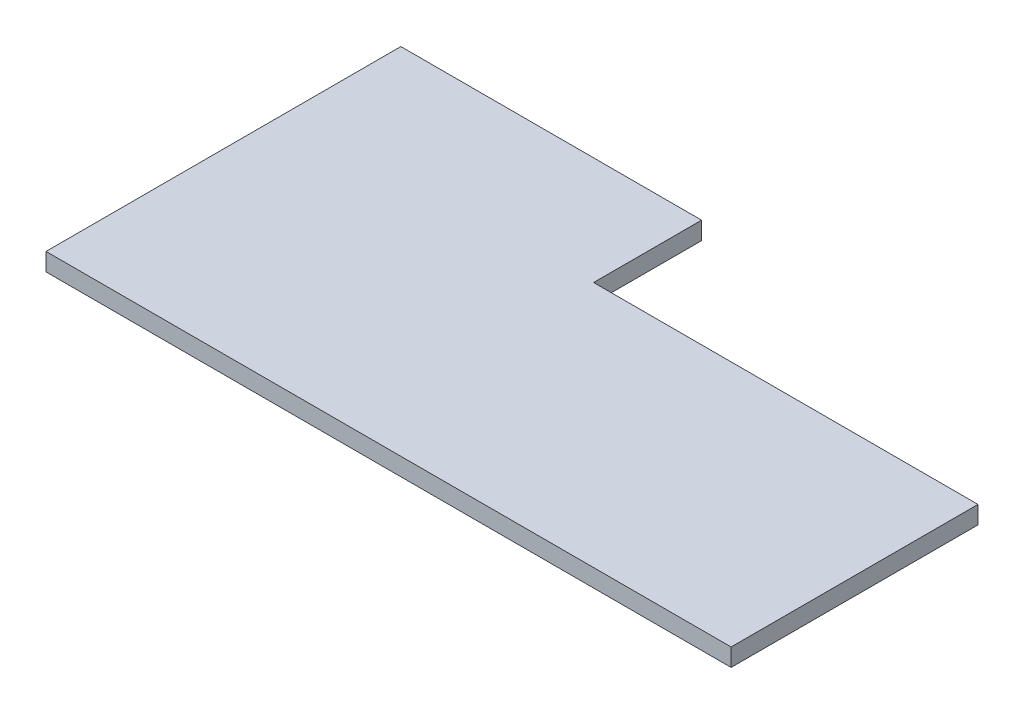
ISO-10303-21;
HEADER;
FILE_DESCRIPTION(('STEP AP214'),'2;1');
FILE_NAME('part.step','',(''),(''),'','','');
FILE_SCHEMA(('AUTOMOTIVE_DESIGN { 1 0 10303 214 1 1 1 1 }'));
ENDSEC;
DATA;
#1=APPLICATION_CONTEXT('core data for automotive mechanical design processes');
#2=APPLICATION_PROTOCOL_DEFINITION('international standard','automotive_design',2000,#1);
#3=PRODUCT_CONTEXT('',#1,'mechanical');
#4=PRODUCT('Part','Part','',(#3));
#5=PRODUCT_RELATED_PRODUCT_CATEGORY('part','',(#4));
#6=PRODUCT_DEFINITION_FORMATION('','',#4);
#7=PRODUCT_DEFINITION_CONTEXT('part definition',#1,'design');
#8=PRODUCT_DEFINITION('design','',#6,#7);
#9=PRODUCT_DEFINITION_SHAPE('','',#8);
#10=(LENGTH_UNIT() NAMED_UNIT(*) SI_UNIT(.MILLI.,.METRE.));
#11=(NAMED_UNIT(*) PLANE_ANGLE_UNIT() SI_UNIT($,.RADIAN.));
#12=(NAMED_UNIT(*) SI_UNIT($,.STERADIAN.) SOLID_ANGLE_UNIT());
#13=UNCERTAINTY_MEASURE_WITH_UNIT(LENGTH_MEASURE(1.E-05),#10,'distance_accuracy_value','');
#14=(GEOMETRIC_REPRESENTATION_CONTEXT(3) GLOBAL_UNCERTAINTY_ASSIGNED_CONTEXT((#13)) GLOBAL_UNIT_ASSIGNED_CONTEXT((#10,
#11,#12)) REPRESENTATION_CONTEXT('',''));
#15=CARTESIAN_POINT('',(0.,0.,0.));
#16=DIRECTION('',(0.,0.,1.));
#17=DIRECTION('',(1.,0.,0.));
#18=AXIS2_PLACEMENT_3D('',#15,#16,#17);
#19=CARTESIAN_POINT('',(35.593368159927,2.95,3.68220593071904));
#20=DIRECTION('',(0.,0.,1.));
#21=DIRECTION('',(1.,0.,0.));
#22=AXIS2_PLACEMENT_3D('',#19,#20,#21);
#23=PLANE('',#22);
#24=DIRECTION('',(-1.,0.,0.));
#25=VECTOR('',#24,1.);
#26=CARTESIAN_POINT('',(35.593368159927,0.,3.68220593071904));
#27=LINE('',#26,#25);
#28=CARTESIAN_POINT('',(99.503368159927,0.,3.68220593071904));
#29=VERTEX_POINT('',#28);
#30=CARTESIAN_POINT('',(35.593368159927,0.,3.68220593071904));
#31=VERTEX_POINT('',#30);
#32=EDGE_CURVE('E116',#29,#31,#27,.T.);
#33=ORIENTED_EDGE('',*,*,#32,.T.);
#34=DIRECTION('',(0.,-1.,0.));
#35=VECTOR('',#34,1.);
#36=CARTESIAN_POINT('',(35.593368159927,2.95,3.68220593071904));
#37=LINE('',#36,#35);
#38=CARTESIAN_POINT('',(35.593368159927,2.95,3.68220593071904));
#39=VERTEX_POINT('',#38);
#40=EDGE_CURVE('E11',#39,#31,#37,.T.);
#41=ORIENTED_EDGE('',*,*,#40,.F.);
#42=DIRECTION('',(-1.,0.,0.));
#43=VECTOR('',#42,1.);
#44=CARTESIAN_POINT('',(35.593368159927,2.95,3.68220593071904));
#45=LINE('',#44,#43);
#46=CARTESIAN_POINT('',(99.503368159927,2.95,3.68220593071904));
#47=VERTEX_POINT('',#46);
#48=EDGE_CURVE('E127',#47,#39,#45,.T.);
#49=ORIENTED_EDGE('',*,*,#48,.F.);
#50=DIRECTION('',(0.,-1.,0.));
#51=VECTOR('',#50,1.);
#52=CARTESIAN_POINT('',(99.503368159927,2.95,3.68220593071904));
#53=LINE('',#52,#51);
#54=EDGE_CURVE('E112',#47,#29,#53,.T.);
#55=ORIENTED_EDGE('',*,*,#54,.T.);
#56=EDGE_LOOP('',(#33,#41,#49,#55));
#57=FACE_BOUND('',#56,.T.);
#58=ADVANCED_FACE('F33',(#57),#23,.F.);
#59=CARTESIAN_POINT('',(35.593368159927,2.95,-14.267794069281));
#60=DIRECTION('',(-1.,0.,0.));
#61=DIRECTION('',(0.,0.,1.));
#62=AXIS2_PLACEMENT_3D('',#59,#60,#61);
#63=PLANE('',#62);
#64=DIRECTION('',(0.,0.,-1.));
#65=VECTOR('',#64,1.);
#66=CARTESIAN_POINT('',(35.593368159927,0.,-14.267794069281));
#67=LINE('',#66,#65);
#68=CARTESIAN_POINT('',(35.593368159927,0.,-14.267794069281));
#69=VERTEX_POINT('',#68);
#70=EDGE_CURVE('E119',#31,#69,#67,.T.);
#71=ORIENTED_EDGE('',*,*,#70,.T.);
#72=DIRECTION('',(0.,-1.,0.));
#73=VECTOR('',#72,1.);
#74=CARTESIAN_POINT('',(35.593368159927,2.95,-14.267794069281));
#75=LINE('',#74,#73);
#76=CARTESIAN_POINT('',(35.593368159927,2.95,-14.267794069281));
#77=VERTEX_POINT('',#76);
#78=EDGE_CURVE('E41',#77,#69,#75,.T.);
#79=ORIENTED_EDGE('',*,*,#78,.F.);
#80=DIRECTION('',(0.,0.,-1.));
#81=VECTOR('',#80,1.);
#82=CARTESIAN_POINT('',(35.593368159927,2.95,-14.267794069281));
#83=LINE('',#82,#81);
#84=EDGE_CURVE('E86',#39,#77,#83,.T.);
#85=ORIENTED_EDGE('',*,*,#84,.F.);
#86=ORIENTED_EDGE('',*,*,#40,.T.);
#87=EDGE_LOOP('',(#71,#79,#85,#86));
#88=FACE_BOUND('',#87,.T.);
#89=ADVANCED_FACE('F151',(#88),#63,.F.);
#90=CARTESIAN_POINT('',(-14.406631840073,2.95,-14.267794069281));
#91=DIRECTION('',(0.,0.,1.));
#92=DIRECTION('',(1.,0.,0.));
#93=AXIS2_PLACEMENT_3D('',#90,#91,#92);
#94=PLANE('',#93);
#95=DIRECTION('',(-1.,0.,0.));
#96=VECTOR('',#95,1.);
#97=CARTESIAN_POINT('',(-14.406631840073,0.,-14.267794069281));
#98=LINE('',#97,#96);
#99=CARTESIAN_POINT('',(-14.406631840073,0.,-14.267794069281));
#100=VERTEX_POINT('',#99);
#101=EDGE_CURVE('E121',#69,#100,#98,.T.);
#102=ORIENTED_EDGE('',*,*,#101,.T.);
#103=DIRECTION('',(0.,-1.,0.));
#104=VECTOR('',#103,1.);
#105=CARTESIAN_POINT('',(-14.406631840073,2.95,-14.267794069281));
#106=LINE('',#105,#104);
#107=CARTESIAN_POINT('',(-14.406631840073,2.95,-14.267794069281));
#108=VERTEX_POINT('',#107);
#109=EDGE_CURVE('E107',#108,#100,#106,.T.);
#110=ORIENTED_EDGE('',*,*,#109,.F.);
#111=DIRECTION('',(-1.,0.,0.));
#112=VECTOR('',#111,1.);
#113=CARTESIAN_POINT('',(-14.406631840073,2.95,-14.267794069281));
#114=LINE('',#113,#112);
#115=EDGE_CURVE('E99',#77,#108,#114,.T.);
#116=ORIENTED_EDGE('',*,*,#115,.F.);
#117=ORIENTED_EDGE('',*,*,#78,.T.);
#118=EDGE_LOOP('',(#102,#110,#116,#117));
#119=FACE_BOUND('',#118,.T.);
#120=ADVANCED_FACE('F133',(#119),#94,.F.);
#121=CARTESIAN_POINT('',(-14.406631840073,2.95,44.732205930719));
#122=DIRECTION('',(1.,0.,0.));
#123=DIRECTION('',(0.,0.,-1.));
#124=AXIS2_PLACEMENT_3D('',#121,#122,#123);
#125=PLANE('',#124);
#126=DIRECTION('',(0.,0.,1.));
#127=VECTOR('',#126,1.);
#128=CARTESIAN_POINT('',(-14.406631840073,0.,44.732205930719));
#129=LINE('',#128,#127);
#130=CARTESIAN_POINT('',(-14.406631840073,0.,44.732205930719));
#131=VERTEX_POINT('',#130);
#132=EDGE_CURVE('E106',#100,#131,#129,.T.);
#133=ORIENTED_EDGE('',*,*,#132,.T.);
#134=DIRECTION('',(0.,-1.,0.));
#135=VECTOR('',#134,1.);
#136=CARTESIAN_POINT('',(-14.406631840073,2.95,44.732205930719));
#137=LINE('',#136,#135);
#138=CARTESIAN_POINT('',(-14.406631840073,2.95,44.732205930719));
#139=VERTEX_POINT('',#138);
#140=EDGE_CURVE('E104',#139,#131,#137,.T.);
#141=ORIENTED_EDGE('',*,*,#140,.F.);
#142=DIRECTION('',(0.,0.,1.));
#143=VECTOR('',#142,1.);
#144=CARTESIAN_POINT('',(-14.406631840073,2.95,0.732205930719043));
#145=LINE('',#144,#143);
#146=EDGE_CURVE('E93',#108,#139,#145,.T.);
#147=ORIENTED_EDGE('',*,*,#146,.F.);
#148=ORIENTED_EDGE('',*,*,#109,.T.);
#149=EDGE_LOOP('',(#133,#141,#147,#148));
#150=FACE_BOUND('',#149,.T.);
#151=ADVANCED_FACE('F105',(#150),#125,.F.);
#152=CARTESIAN_POINT('',(99.503368159927,2.95,44.732205930719));
#153=DIRECTION('',(0.,0.,-1.));
#154=DIRECTION('',(-1.,0.,0.));
#155=AXIS2_PLACEMENT_3D('',#152,#153,#154);
#156=PLANE('',#155);
#157=DIRECTION('',(1.,0.,0.));
#158=VECTOR('',#157,1.);
#159=CARTESIAN_POINT('',(99.503368159927,0.,44.732205930719));
#160=LINE('',#159,#158);
#161=CARTESIAN_POINT('',(99.503368159927,0.,44.732205930719));
#162=VERTEX_POINT('',#161);
#163=EDGE_CURVE('E72',#131,#162,#160,.T.);
#164=ORIENTED_EDGE('',*,*,#163,.T.);
#165=DIRECTION('',(0.,-1.,0.));
#166=VECTOR('',#165,1.);
#167=CARTESIAN_POINT('',(99.503368159927,2.95,44.732205930719));
#168=LINE('',#167,#166);
#169=CARTESIAN_POINT('',(99.503368159927,2.95,44.732205930719));
#170=VERTEX_POINT('',#169);
#171=EDGE_CURVE('E108',#170,#162,#168,.T.);
#172=ORIENTED_EDGE('',*,*,#171,.F.);
#173=DIRECTION('',(1.,0.,0.));
#174=VECTOR('',#173,1.);
#175=CARTESIAN_POINT('',(99.503368159927,2.95,44.732205930719));
#176=LINE('',#175,#174);
#177=EDGE_CURVE('E97',#139,#170,#176,.T.);
#178=ORIENTED_EDGE('',*,*,#177,.F.);
#179=ORIENTED_EDGE('',*,*,#140,.T.);
#180=EDGE_LOOP('',(#164,#172,#178,#179));
#181=FACE_BOUND('',#180,.T.);
#182=ADVANCED_FACE('F110',(#181),#156,.F.);
#183=CARTESIAN_POINT('',(99.503368159927,2.95,3.68220593071904));
#184=DIRECTION('',(-1.,0.,0.));
#185=DIRECTION('',(0.,0.,1.));
#186=AXIS2_PLACEMENT_3D('',#183,#184,#185);
#187=PLANE('',#186);
#188=DIRECTION('',(0.,0.,-1.));
#189=VECTOR('',#188,1.);
#190=CARTESIAN_POINT('',(99.503368159927,0.,3.68220593071904));
#191=LINE('',#190,#189);
#192=EDGE_CURVE('E78',#162,#29,#191,.T.);
#193=ORIENTED_EDGE('',*,*,#192,.T.);
#194=ORIENTED_EDGE('',*,*,#54,.F.);
#195=DIRECTION('',(0.,0.,-1.));
#196=VECTOR('',#195,1.);
#197=CARTESIAN_POINT('',(99.503368159927,2.95,3.68220593071904));
#198=LINE('',#197,#196);
#199=EDGE_CURVE('E49',#170,#47,#198,.T.);
#200=ORIENTED_EDGE('',*,*,#199,.F.);
#201=ORIENTED_EDGE('',*,*,#171,.T.);
#202=EDGE_LOOP('',(#193,#194,#200,#201));
#203=FACE_BOUND('',#202,.T.);
#204=ADVANCED_FACE('F140',(#203),#187,.F.);
#205=CARTESIAN_POINT('',(0.,2.95,0.));
#206=DIRECTION('',(0.,-1.,0.));
#207=DIRECTION('',(0.,0.,-1.));
#208=AXIS2_PLACEMENT_3D('',#205,#206,#207);
#209=PLANE('',#208);
#210=ORIENTED_EDGE('',*,*,#48,.T.);
#211=ORIENTED_EDGE('',*,*,#84,.T.);
#212=ORIENTED_EDGE('',*,*,#115,.T.);
#213=ORIENTED_EDGE('',*,*,#146,.T.);
#214=ORIENTED_EDGE('',*,*,#177,.T.);
#215=ORIENTED_EDGE('',*,*,#199,.T.);
#216=EDGE_LOOP('',(#210,#211,#212,#213,#214,#215));
#217=FACE_BOUND('',#216,.T.);
#218=ADVANCED_FACE('F95',(#217),#209,.F.);
#219=CARTESIAN_POINT('',(0.,0.,0.));
#220=DIRECTION('',(0.,-1.,0.));
#221=DIRECTION('',(0.,0.,-1.));
#222=AXIS2_PLACEMENT_3D('',#219,#220,#221);
#223=PLANE('',#222);
#224=ORIENTED_EDGE('',*,*,#32,.F.);
#225=ORIENTED_EDGE('',*,*,#192,.F.);
#226=ORIENTED_EDGE('',*,*,#163,.F.);
#227=ORIENTED_EDGE('',*,*,#132,.F.);
#228=ORIENTED_EDGE('',*,*,#101,.F.);
#229=ORIENTED_EDGE('',*,*,#70,.F.);
#230=EDGE_LOOP('',(#224,#225,#226,#227,#228,#229));
#231=FACE_BOUND('',#230,.T.);
#232=ADVANCED_FACE('F136',(#231),#223,.T.);
#233=CLOSED_SHELL('',(#58,#89,#120,#151,#182,#204,#218,#232));
#234=MANIFOLD_SOLID_BREP('B2',#233);
#235=ADVANCED_BREP_SHAPE_REPRESENTATION('',(#18,#234),#14);
#236=SHAPE_DEFINITION_REPRESENTATION(#9,#235);
ENDSEC;
END-ISO-10303-21;
